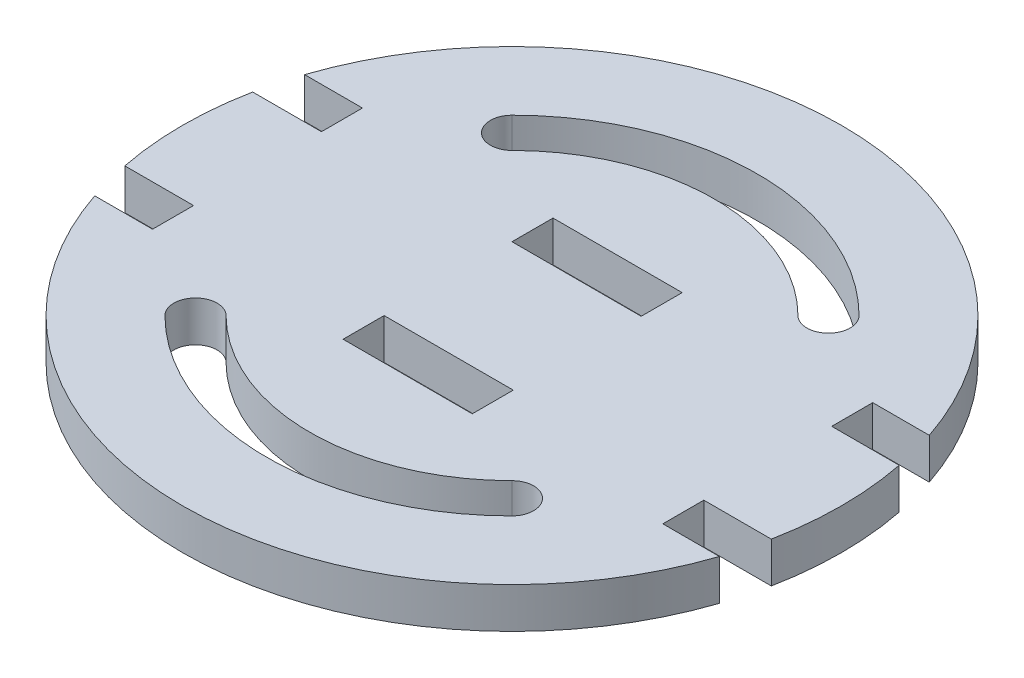
ISO-10303-21;
HEADER;
FILE_DESCRIPTION(('STEP AP214'),'2;1');
FILE_NAME('part.step','',(''),(''),'','','');
FILE_SCHEMA(('AUTOMOTIVE_DESIGN { 1 0 10303 214 1 1 1 1 }'));
ENDSEC;
DATA;
#1=APPLICATION_CONTEXT('core data for automotive mechanical design processes');
#2=APPLICATION_PROTOCOL_DEFINITION('international standard','automotive_design',2000,#1);
#3=PRODUCT_CONTEXT('',#1,'mechanical');
#4=PRODUCT('Part','Part','',(#3));
#5=PRODUCT_RELATED_PRODUCT_CATEGORY('part','',(#4));
#6=PRODUCT_DEFINITION_FORMATION('','',#4);
#7=PRODUCT_DEFINITION_CONTEXT('part definition',#1,'design');
#8=PRODUCT_DEFINITION('design','',#6,#7);
#9=PRODUCT_DEFINITION_SHAPE('','',#8);
#10=(LENGTH_UNIT() NAMED_UNIT(*) SI_UNIT(.MILLI.,.METRE.));
#11=(NAMED_UNIT(*) PLANE_ANGLE_UNIT() SI_UNIT($,.RADIAN.));
#12=(NAMED_UNIT(*) SI_UNIT($,.STERADIAN.) SOLID_ANGLE_UNIT());
#13=UNCERTAINTY_MEASURE_WITH_UNIT(LENGTH_MEASURE(1.E-05),#10,'distance_accuracy_value','');
#14=(GEOMETRIC_REPRESENTATION_CONTEXT(3) GLOBAL_UNCERTAINTY_ASSIGNED_CONTEXT((#13)) GLOBAL_UNIT_ASSIGNED_CONTEXT((#10,
#11,#12)) REPRESENTATION_CONTEXT('',''));
#15=CARTESIAN_POINT('',(0.,0.,0.));
#16=DIRECTION('',(0.,0.,1.));
#17=DIRECTION('',(1.,0.,0.));
#18=AXIS2_PLACEMENT_3D('',#15,#16,#17);
#19=CARTESIAN_POINT('',(0.,6.35,16.4135));
#20=DIRECTION('',(0.,0.,1.));
#21=DIRECTION('',(1.,0.,0.));
#22=AXIS2_PLACEMENT_3D('',#19,#20,#21);
#23=PLANE('',#22);
#24=DIRECTION('',(-1.,0.,0.));
#25=VECTOR('',#24,1.);
#26=CARTESIAN_POINT('',(0.,0.,16.4135));
#27=LINE('',#26,#25);
#28=CARTESIAN_POINT('',(10.2,0.,16.4135));
#29=VERTEX_POINT('',#28);
#30=CARTESIAN_POINT('',(-10.,0.,16.4135));
#31=VERTEX_POINT('',#30);
#32=EDGE_CURVE('E422',#29,#31,#27,.T.);
#33=ORIENTED_EDGE('',*,*,#32,.T.);
#34=DIRECTION('',(0.,-1.,0.));
#35=VECTOR('',#34,1.);
#36=CARTESIAN_POINT('',(-10.,6.35,16.4135));
#37=LINE('',#36,#35);
#38=CARTESIAN_POINT('',(-10.,6.35,16.4135));
#39=VERTEX_POINT('',#38);
#40=EDGE_CURVE('E11',#39,#31,#37,.T.);
#41=ORIENTED_EDGE('',*,*,#40,.F.);
#42=DIRECTION('',(-1.,0.,0.));
#43=VECTOR('',#42,1.);
#44=CARTESIAN_POINT('',(0.,6.35,16.4135));
#45=LINE('',#44,#43);
#46=CARTESIAN_POINT('',(10.2,6.35,16.4135));
#47=VERTEX_POINT('',#46);
#48=EDGE_CURVE('E364',#47,#39,#45,.T.);
#49=ORIENTED_EDGE('',*,*,#48,.F.);
#50=DIRECTION('',(0.,-1.,0.));
#51=VECTOR('',#50,1.);
#52=CARTESIAN_POINT('',(10.2,6.35,16.4135));
#53=LINE('',#52,#51);
#54=EDGE_CURVE('E430',#47,#29,#53,.T.);
#55=ORIENTED_EDGE('',*,*,#54,.T.);
#56=EDGE_LOOP('',(#33,#41,#49,#55));
#57=FACE_BOUND('',#56,.T.);
#58=ADVANCED_FACE('F35',(#57),#23,.F.);
#59=CARTESIAN_POINT('',(-10.,6.35,0.));
#60=DIRECTION('',(-1.,0.,0.));
#61=DIRECTION('',(0.,0.,1.));
#62=AXIS2_PLACEMENT_3D('',#59,#60,#61);
#63=PLANE('',#62);
#64=DIRECTION('',(0.,0.,-1.));
#65=VECTOR('',#64,1.);
#66=CARTESIAN_POINT('',(-10.,0.,0.));
#67=LINE('',#66,#65);
#68=CARTESIAN_POINT('',(-10.,0.,10.));
#69=VERTEX_POINT('',#68);
#70=EDGE_CURVE('E425',#31,#69,#67,.T.);
#71=ORIENTED_EDGE('',*,*,#70,.T.);
#72=DIRECTION('',(0.,-1.,0.));
#73=VECTOR('',#72,1.);
#74=CARTESIAN_POINT('',(-10.,6.35,10.));
#75=LINE('',#74,#73);
#76=CARTESIAN_POINT('',(-10.,6.35,10.));
#77=VERTEX_POINT('',#76);
#78=EDGE_CURVE('E44',#77,#69,#75,.T.);
#79=ORIENTED_EDGE('',*,*,#78,.F.);
#80=DIRECTION('',(0.,0.,-1.));
#81=VECTOR('',#80,1.);
#82=CARTESIAN_POINT('',(-10.,6.35,0.));
#83=LINE('',#82,#81);
#84=EDGE_CURVE('E367',#39,#77,#83,.T.);
#85=ORIENTED_EDGE('',*,*,#84,.F.);
#86=ORIENTED_EDGE('',*,*,#40,.T.);
#87=EDGE_LOOP('',(#71,#79,#85,#86));
#88=FACE_BOUND('',#87,.T.);
#89=ADVANCED_FACE('F516',(#88),#63,.F.);
#90=CARTESIAN_POINT('',(0.,6.35,10.));
#91=DIRECTION('',(0.,0.,-1.));
#92=DIRECTION('',(-1.,0.,0.));
#93=AXIS2_PLACEMENT_3D('',#90,#91,#92);
#94=PLANE('',#93);
#95=DIRECTION('',(1.,0.,0.));
#96=VECTOR('',#95,1.);
#97=CARTESIAN_POINT('',(0.,0.,10.));
#98=LINE('',#97,#96);
#99=CARTESIAN_POINT('',(10.2,0.,10.));
#100=VERTEX_POINT('',#99);
#101=EDGE_CURVE('E427',#69,#100,#98,.T.);
#102=ORIENTED_EDGE('',*,*,#101,.T.);
#103=DIRECTION('',(0.,-1.,0.));
#104=VECTOR('',#103,1.);
#105=CARTESIAN_POINT('',(10.2,6.35,10.));
#106=LINE('',#105,#104);
#107=CARTESIAN_POINT('',(10.2,6.35,10.));
#108=VERTEX_POINT('',#107);
#109=EDGE_CURVE('E433',#108,#100,#106,.T.);
#110=ORIENTED_EDGE('',*,*,#109,.F.);
#111=DIRECTION('',(1.,0.,0.));
#112=VECTOR('',#111,1.);
#113=CARTESIAN_POINT('',(0.,6.35,10.));
#114=LINE('',#113,#112);
#115=EDGE_CURVE('E369',#77,#108,#114,.T.);
#116=ORIENTED_EDGE('',*,*,#115,.F.);
#117=ORIENTED_EDGE('',*,*,#78,.T.);
#118=EDGE_LOOP('',(#102,#110,#116,#117));
#119=FACE_BOUND('',#118,.T.);
#120=ADVANCED_FACE('F522',(#119),#94,.F.);
#121=CARTESIAN_POINT('',(0.,6.35,0.));
#122=DIRECTION('',(0.,-1.,0.));
#123=DIRECTION('',(0.,0.,-1.));
#124=AXIS2_PLACEMENT_3D('',#121,#122,#123);
#125=CYLINDRICAL_SURFACE('',#124,51.5305);
#126=CARTESIAN_POINT('',(0.,0.,0.));
#127=DIRECTION('',(0.,1.,0.));
#128=DIRECTION('',(0.,0.,1.));
#129=AXIS2_PLACEMENT_3D('',#126,#127,#128);
#130=CIRCLE('',#129,51.5305);
#131=CARTESIAN_POINT('',(-50.550889509978,0.,-9.99999999999999));
#132=VERTEX_POINT('',#131);
#133=CARTESIAN_POINT('',(-50.550889509978,0.,9.99999999999999));
#134=VERTEX_POINT('',#133);
#135=EDGE_CURVE('E385',#132,#134,#130,.T.);
#136=ORIENTED_EDGE('',*,*,#135,.T.);
#137=DIRECTION('',(0.,-1.,0.));
#138=VECTOR('',#137,1.);
#139=CARTESIAN_POINT('',(-50.550889509978,6.35,9.99999999999999));
#140=LINE('',#139,#138);
#141=CARTESIAN_POINT('',(-50.550889509978,6.35,9.99999999999999));
#142=VERTEX_POINT('',#141);
#143=EDGE_CURVE('E434',#142,#134,#140,.T.);
#144=ORIENTED_EDGE('',*,*,#143,.F.);
#145=CARTESIAN_POINT('',(0.,6.35,0.));
#146=DIRECTION('',(0.,1.,0.));
#147=DIRECTION('',(0.,0.,1.));
#148=AXIS2_PLACEMENT_3D('',#145,#146,#147);
#149=CIRCLE('',#148,51.5305);
#150=CARTESIAN_POINT('',(-50.550889509978,6.35,-9.99999999999999));
#151=VERTEX_POINT('',#150);
#152=EDGE_CURVE('E328',#151,#142,#149,.T.);
#153=ORIENTED_EDGE('',*,*,#152,.F.);
#154=DIRECTION('',(0.,-1.,0.));
#155=VECTOR('',#154,1.);
#156=CARTESIAN_POINT('',(-50.550889509978,6.35,-9.99999999999999));
#157=LINE('',#156,#155);
#158=EDGE_CURVE('E439',#151,#132,#157,.T.);
#159=ORIENTED_EDGE('',*,*,#158,.T.);
#160=EDGE_LOOP('',(#136,#144,#153,#159));
#161=FACE_BOUND('',#160,.T.);
#162=ADVANCED_FACE('F540',(#161),#125,.T.);
#163=CARTESIAN_POINT('',(0.,6.35,10.));
#164=DIRECTION('',(0.,0.,1.));
#165=DIRECTION('',(1.,0.,0.));
#166=AXIS2_PLACEMENT_3D('',#163,#164,#165);
#167=PLANE('',#166);
#168=DIRECTION('',(-1.,0.,0.));
#169=VECTOR('',#168,1.);
#170=CARTESIAN_POINT('',(0.,0.,10.));
#171=LINE('',#170,#169);
#172=CARTESIAN_POINT('',(-39.8,0.,10.));
#173=VERTEX_POINT('',#172);
#174=EDGE_CURVE('E388',#173,#134,#171,.T.);
#175=ORIENTED_EDGE('',*,*,#174,.F.);
#176=DIRECTION('',(0.,-1.,0.));
#177=VECTOR('',#176,1.);
#178=CARTESIAN_POINT('',(-39.8,6.35,10.));
#179=LINE('',#178,#177);
#180=CARTESIAN_POINT('',(-39.8,6.35,10.));
#181=VERTEX_POINT('',#180);
#182=EDGE_CURVE('E475',#181,#173,#179,.T.);
#183=ORIENTED_EDGE('',*,*,#182,.F.);
#184=DIRECTION('',(-1.,0.,0.));
#185=VECTOR('',#184,1.);
#186=CARTESIAN_POINT('',(0.,6.35,10.));
#187=LINE('',#186,#185);
#188=EDGE_CURVE('E330',#181,#142,#187,.T.);
#189=ORIENTED_EDGE('',*,*,#188,.T.);
#190=ORIENTED_EDGE('',*,*,#143,.T.);
#191=EDGE_LOOP('',(#175,#183,#189,#190));
#192=FACE_BOUND('',#191,.T.);
#193=ADVANCED_FACE('F575',(#192),#167,.T.);
#194=CARTESIAN_POINT('',(-39.8,6.35,0.));
#195=DIRECTION('',(-1.,0.,0.));
#196=DIRECTION('',(0.,0.,1.));
#197=AXIS2_PLACEMENT_3D('',#194,#195,#196);
#198=PLANE('',#197);
#199=DIRECTION('',(0.,0.,-1.));
#200=VECTOR('',#199,1.);
#201=CARTESIAN_POINT('',(-39.8,0.,0.));
#202=LINE('',#201,#200);
#203=CARTESIAN_POINT('',(-39.8,0.,16.4135));
#204=VERTEX_POINT('',#203);
#205=EDGE_CURVE('E393',#204,#173,#202,.T.);
#206=ORIENTED_EDGE('',*,*,#205,.F.);
#207=DIRECTION('',(0.,-1.,0.));
#208=VECTOR('',#207,1.);
#209=CARTESIAN_POINT('',(-39.8,6.35,16.4135));
#210=LINE('',#209,#208);
#211=CARTESIAN_POINT('',(-39.8,6.35,16.4135));
#212=VERTEX_POINT('',#211);
#213=EDGE_CURVE('E473',#212,#204,#210,.T.);
#214=ORIENTED_EDGE('',*,*,#213,.F.);
#215=DIRECTION('',(0.,0.,-1.));
#216=VECTOR('',#215,1.);
#217=CARTESIAN_POINT('',(-39.8,6.35,0.));
#218=LINE('',#217,#216);
#219=EDGE_CURVE('E335',#212,#181,#218,.T.);
#220=ORIENTED_EDGE('',*,*,#219,.T.);
#221=ORIENTED_EDGE('',*,*,#182,.T.);
#222=EDGE_LOOP('',(#206,#214,#220,#221));
#223=FACE_BOUND('',#222,.T.);
#224=ADVANCED_FACE('F572',(#223),#198,.T.);
#225=CARTESIAN_POINT('',(0.,6.35,16.4135));
#226=DIRECTION('',(0.,0.,-1.));
#227=DIRECTION('',(-1.,0.,0.));
#228=AXIS2_PLACEMENT_3D('',#225,#226,#227);
#229=PLANE('',#228);
#230=DIRECTION('',(1.,0.,0.));
#231=VECTOR('',#230,1.);
#232=CARTESIAN_POINT('',(0.,0.,16.4135));
#233=LINE('',#232,#231);
#234=CARTESIAN_POINT('',(-48.8465909557668,0.,16.4135));
#235=VERTEX_POINT('',#234);
#236=EDGE_CURVE('E396',#235,#204,#233,.T.);
#237=ORIENTED_EDGE('',*,*,#236,.F.);
#238=DIRECTION('',(0.,-1.,0.));
#239=VECTOR('',#238,1.);
#240=CARTESIAN_POINT('',(-48.8465909557668,6.35,16.4135));
#241=LINE('',#240,#239);
#242=CARTESIAN_POINT('',(-48.8465909557668,6.35,16.4135));
#243=VERTEX_POINT('',#242);
#244=EDGE_CURVE('E471',#243,#235,#241,.T.);
#245=ORIENTED_EDGE('',*,*,#244,.F.);
#246=DIRECTION('',(1.,0.,0.));
#247=VECTOR('',#246,1.);
#248=CARTESIAN_POINT('',(0.,6.35,16.4135));
#249=LINE('',#248,#247);
#250=EDGE_CURVE('E338',#243,#212,#249,.T.);
#251=ORIENTED_EDGE('',*,*,#250,.T.);
#252=ORIENTED_EDGE('',*,*,#213,.T.);
#253=EDGE_LOOP('',(#237,#245,#251,#252));
#254=FACE_BOUND('',#253,.T.);
#255=ADVANCED_FACE('F568',(#254),#229,.T.);
#256=CARTESIAN_POINT('',(0.,6.35,0.));
#257=DIRECTION('',(0.,-1.,0.));
#258=DIRECTION('',(0.,0.,-1.));
#259=AXIS2_PLACEMENT_3D('',#256,#257,#258);
#260=CYLINDRICAL_SURFACE('',#259,51.5305);
#261=CARTESIAN_POINT('',(0.,0.,0.));
#262=DIRECTION('',(0.,1.,0.));
#263=DIRECTION('',(0.,0.,1.));
#264=AXIS2_PLACEMENT_3D('',#261,#262,#263);
#265=CIRCLE('',#264,51.5305);
#266=CARTESIAN_POINT('',(48.8465909557668,0.,16.4135));
#267=VERTEX_POINT('',#266);
#268=EDGE_CURVE('E399',#235,#267,#265,.T.);
#269=ORIENTED_EDGE('',*,*,#268,.T.);
#270=DIRECTION('',(0.,-1.,0.));
#271=VECTOR('',#270,1.);
#272=CARTESIAN_POINT('',(48.8465909557668,6.35,16.4135));
#273=LINE('',#272,#271);
#274=CARTESIAN_POINT('',(48.8465909557668,6.35,16.4135));
#275=VERTEX_POINT('',#274);
#276=EDGE_CURVE('E468',#275,#267,#273,.T.);
#277=ORIENTED_EDGE('',*,*,#276,.F.);
#278=CARTESIAN_POINT('',(0.,6.35,0.));
#279=DIRECTION('',(0.,1.,0.));
#280=DIRECTION('',(0.,0.,1.));
#281=AXIS2_PLACEMENT_3D('',#278,#279,#280);
#282=CIRCLE('',#281,51.5305);
#283=EDGE_CURVE('E341',#243,#275,#282,.T.);
#284=ORIENTED_EDGE('',*,*,#283,.F.);
#285=ORIENTED_EDGE('',*,*,#244,.T.);
#286=EDGE_LOOP('',(#269,#277,#284,#285));
#287=FACE_BOUND('',#286,.T.);
#288=ADVANCED_FACE('F564',(#287),#260,.T.);
#289=CARTESIAN_POINT('',(0.,6.35,16.4135));
#290=DIRECTION('',(0.,0.,1.));
#291=DIRECTION('',(1.,0.,0.));
#292=AXIS2_PLACEMENT_3D('',#289,#290,#291);
#293=PLANE('',#292);
#294=DIRECTION('',(-1.,0.,0.));
#295=VECTOR('',#294,1.);
#296=CARTESIAN_POINT('',(0.,0.,16.4135));
#297=LINE('',#296,#295);
#298=CARTESIAN_POINT('',(40.,0.,16.4135));
#299=VERTEX_POINT('',#298);
#300=EDGE_CURVE('E401',#267,#299,#297,.T.);
#301=ORIENTED_EDGE('',*,*,#300,.T.);
#302=DIRECTION('',(0.,-1.,0.));
#303=VECTOR('',#302,1.);
#304=CARTESIAN_POINT('',(40.,6.35,16.4135));
#305=LINE('',#304,#303);
#306=CARTESIAN_POINT('',(40.,6.35,16.4135));
#307=VERTEX_POINT('',#306);
#308=EDGE_CURVE('E465',#307,#299,#305,.T.);
#309=ORIENTED_EDGE('',*,*,#308,.F.);
#310=DIRECTION('',(-1.,0.,0.));
#311=VECTOR('',#310,1.);
#312=CARTESIAN_POINT('',(0.,6.35,16.4135));
#313=LINE('',#312,#311);
#314=EDGE_CURVE('E343',#275,#307,#313,.T.);
#315=ORIENTED_EDGE('',*,*,#314,.F.);
#316=ORIENTED_EDGE('',*,*,#276,.T.);
#317=EDGE_LOOP('',(#301,#309,#315,#316));
#318=FACE_BOUND('',#317,.T.);
#319=ADVANCED_FACE('F560',(#318),#293,.F.);
#320=CARTESIAN_POINT('',(40.,6.35,0.));
#321=DIRECTION('',(-1.,0.,0.));
#322=DIRECTION('',(0.,0.,1.));
#323=AXIS2_PLACEMENT_3D('',#320,#321,#322);
#324=PLANE('',#323);
#325=DIRECTION('',(0.,0.,-1.));
#326=VECTOR('',#325,1.);
#327=CARTESIAN_POINT('',(40.,0.,0.));
#328=LINE('',#327,#326);
#329=CARTESIAN_POINT('',(40.,0.,10.));
#330=VERTEX_POINT('',#329);
#331=EDGE_CURVE('E403',#299,#330,#328,.T.);
#332=ORIENTED_EDGE('',*,*,#331,.T.);
#333=DIRECTION('',(0.,-1.,0.));
#334=VECTOR('',#333,1.);
#335=CARTESIAN_POINT('',(40.,6.35,10.));
#336=LINE('',#335,#334);
#337=CARTESIAN_POINT('',(40.,6.35,10.));
#338=VERTEX_POINT('',#337);
#339=EDGE_CURVE('E462',#338,#330,#336,.T.);
#340=ORIENTED_EDGE('',*,*,#339,.F.);
#341=DIRECTION('',(0.,0.,-1.));
#342=VECTOR('',#341,1.);
#343=CARTESIAN_POINT('',(40.,6.35,0.));
#344=LINE('',#343,#342);
#345=EDGE_CURVE('E345',#307,#338,#344,.T.);
#346=ORIENTED_EDGE('',*,*,#345,.F.);
#347=ORIENTED_EDGE('',*,*,#308,.T.);
#348=EDGE_LOOP('',(#332,#340,#346,#347));
#349=FACE_BOUND('',#348,.T.);
#350=ADVANCED_FACE('F556',(#349),#324,.F.);
#351=CARTESIAN_POINT('',(0.,6.35,9.99999999999998));
#352=DIRECTION('',(0.,0.,-1.));
#353=DIRECTION('',(-1.,0.,0.));
#354=AXIS2_PLACEMENT_3D('',#351,#352,#353);
#355=PLANE('',#354);
#356=DIRECTION('',(1.,0.,0.));
#357=VECTOR('',#356,1.);
#358=CARTESIAN_POINT('',(0.,0.,9.99999999999998));
#359=LINE('',#358,#357);
#360=CARTESIAN_POINT('',(50.550889509978,0.,10.));
#361=VERTEX_POINT('',#360);
#362=EDGE_CURVE('E405',#330,#361,#359,.T.);
#363=ORIENTED_EDGE('',*,*,#362,.T.);
#364=DIRECTION('',(0.,-1.,0.));
#365=VECTOR('',#364,1.);
#366=CARTESIAN_POINT('',(50.550889509978,6.35,10.));
#367=LINE('',#366,#365);
#368=CARTESIAN_POINT('',(50.550889509978,6.35,10.));
#369=VERTEX_POINT('',#368);
#370=EDGE_CURVE('E459',#369,#361,#367,.T.);
#371=ORIENTED_EDGE('',*,*,#370,.F.);
#372=DIRECTION('',(1.,0.,0.));
#373=VECTOR('',#372,1.);
#374=CARTESIAN_POINT('',(0.,6.35,9.99999999999998));
#375=LINE('',#374,#373);
#376=EDGE_CURVE('E347',#338,#369,#375,.T.);
#377=ORIENTED_EDGE('',*,*,#376,.F.);
#378=ORIENTED_EDGE('',*,*,#339,.T.);
#379=EDGE_LOOP('',(#363,#371,#377,#378));
#380=FACE_BOUND('',#379,.T.);
#381=ADVANCED_FACE('F553',(#380),#355,.F.);
#382=CARTESIAN_POINT('',(50.550889509978,0.,-10.));
#383=VERTEX_POINT('',#382);
#384=EDGE_CURVE('E390',#361,#383,#130,.T.);
#385=ORIENTED_EDGE('',*,*,#384,.T.);
#386=DIRECTION('',(0.,-1.,0.));
#387=VECTOR('',#386,1.);
#388=CARTESIAN_POINT('',(50.550889509978,6.35,-10.));
#389=LINE('',#388,#387);
#390=CARTESIAN_POINT('',(50.550889509978,6.35,-10.));
#391=VERTEX_POINT('',#390);
#392=EDGE_CURVE('E457',#391,#383,#389,.T.);
#393=ORIENTED_EDGE('',*,*,#392,.F.);
#394=EDGE_CURVE('E332',#369,#391,#149,.T.);
#395=ORIENTED_EDGE('',*,*,#394,.F.);
#396=ORIENTED_EDGE('',*,*,#370,.T.);
#397=EDGE_LOOP('',(#385,#393,#395,#396));
#398=FACE_BOUND('',#397,.T.);
#399=ADVANCED_FACE('F541',(#398),#125,.T.);
#400=CARTESIAN_POINT('',(0.,6.35,-9.99999999999998));
#401=DIRECTION('',(0.,0.,-1.));
#402=DIRECTION('',(-1.,0.,0.));
#403=AXIS2_PLACEMENT_3D('',#400,#401,#402);
#404=PLANE('',#403);
#405=DIRECTION('',(1.,0.,0.));
#406=VECTOR('',#405,1.);
#407=CARTESIAN_POINT('',(0.,0.,-9.99999999999998));
#408=LINE('',#407,#406);
#409=CARTESIAN_POINT('',(40.,0.,-10.));
#410=VERTEX_POINT('',#409);
#411=EDGE_CURVE('E407',#410,#383,#408,.T.);
#412=ORIENTED_EDGE('',*,*,#411,.F.);
#413=DIRECTION('',(0.,-1.,0.));
#414=VECTOR('',#413,1.);
#415=CARTESIAN_POINT('',(40.,6.35,-10.));
#416=LINE('',#415,#414);
#417=CARTESIAN_POINT('',(40.,6.35,-10.));
#418=VERTEX_POINT('',#417);
#419=EDGE_CURVE('E455',#418,#410,#416,.T.);
#420=ORIENTED_EDGE('',*,*,#419,.F.);
#421=DIRECTION('',(1.,0.,0.));
#422=VECTOR('',#421,1.);
#423=CARTESIAN_POINT('',(0.,6.35,-9.99999999999998));
#424=LINE('',#423,#422);
#425=EDGE_CURVE('E349',#418,#391,#424,.T.);
#426=ORIENTED_EDGE('',*,*,#425,.T.);
#427=ORIENTED_EDGE('',*,*,#392,.T.);
#428=EDGE_LOOP('',(#412,#420,#426,#427));
#429=FACE_BOUND('',#428,.T.);
#430=ADVANCED_FACE('F548',(#429),#404,.T.);
#431=CARTESIAN_POINT('',(40.,6.35,0.));
#432=DIRECTION('',(1.,0.,0.));
#433=DIRECTION('',(0.,0.,-1.));
#434=AXIS2_PLACEMENT_3D('',#431,#432,#433);
#435=PLANE('',#434);
#436=DIRECTION('',(0.,0.,1.));
#437=VECTOR('',#436,1.);
#438=CARTESIAN_POINT('',(40.,0.,0.));
#439=LINE('',#438,#437);
#440=CARTESIAN_POINT('',(40.,0.,-16.4135));
#441=VERTEX_POINT('',#440);
#442=EDGE_CURVE('E410',#441,#410,#439,.T.);
#443=ORIENTED_EDGE('',*,*,#442,.F.);
#444=DIRECTION('',(0.,-1.,0.));
#445=VECTOR('',#444,1.);
#446=CARTESIAN_POINT('',(40.,6.35,-16.4135));
#447=LINE('',#446,#445);
#448=CARTESIAN_POINT('',(40.,6.35,-16.4135));
#449=VERTEX_POINT('',#448);
#450=EDGE_CURVE('E453',#449,#441,#447,.T.);
#451=ORIENTED_EDGE('',*,*,#450,.F.);
#452=DIRECTION('',(0.,0.,1.));
#453=VECTOR('',#452,1.);
#454=CARTESIAN_POINT('',(40.,6.35,0.));
#455=LINE('',#454,#453);
#456=EDGE_CURVE('E352',#449,#418,#455,.T.);
#457=ORIENTED_EDGE('',*,*,#456,.T.);
#458=ORIENTED_EDGE('',*,*,#419,.T.);
#459=EDGE_LOOP('',(#443,#451,#457,#458));
#460=FACE_BOUND('',#459,.T.);
#461=ADVANCED_FACE('F544',(#460),#435,.T.);
#462=CARTESIAN_POINT('',(0.,6.35,-16.4135));
#463=DIRECTION('',(0.,0.,1.));
#464=DIRECTION('',(1.,0.,0.));
#465=AXIS2_PLACEMENT_3D('',#462,#463,#464);
#466=PLANE('',#465);
#467=DIRECTION('',(-1.,0.,0.));
#468=VECTOR('',#467,1.);
#469=CARTESIAN_POINT('',(0.,0.,-16.4135));
#470=LINE('',#469,#468);
#471=CARTESIAN_POINT('',(48.8465909557668,0.,-16.4135));
#472=VERTEX_POINT('',#471);
#473=EDGE_CURVE('E413',#472,#441,#470,.T.);
#474=ORIENTED_EDGE('',*,*,#473,.F.);
#475=DIRECTION('',(0.,-1.,0.));
#476=VECTOR('',#475,1.);
#477=CARTESIAN_POINT('',(48.8465909557668,6.35,-16.4135));
#478=LINE('',#477,#476);
#479=CARTESIAN_POINT('',(48.8465909557668,6.35,-16.4135));
#480=VERTEX_POINT('',#479);
#481=EDGE_CURVE('E451',#480,#472,#478,.T.);
#482=ORIENTED_EDGE('',*,*,#481,.F.);
#483=DIRECTION('',(-1.,0.,0.));
#484=VECTOR('',#483,1.);
#485=CARTESIAN_POINT('',(0.,6.35,-16.4135));
#486=LINE('',#485,#484);
#487=EDGE_CURVE('E355',#480,#449,#486,.T.);
#488=ORIENTED_EDGE('',*,*,#487,.T.);
#489=ORIENTED_EDGE('',*,*,#450,.T.);
#490=EDGE_LOOP('',(#474,#482,#488,#489));
#491=FACE_BOUND('',#490,.T.);
#492=ADVANCED_FACE('F538',(#491),#466,.T.);
#493=CARTESIAN_POINT('',(-48.8465909557668,0.,-16.4135));
#494=VERTEX_POINT('',#493);
#495=EDGE_CURVE('E389',#472,#494,#130,.T.);
#496=ORIENTED_EDGE('',*,*,#495,.T.);
#497=DIRECTION('',(0.,-1.,0.));
#498=VECTOR('',#497,1.);
#499=CARTESIAN_POINT('',(-48.8465909557668,6.35,-16.4135));
#500=LINE('',#499,#498);
#501=CARTESIAN_POINT('',(-48.8465909557668,6.35,-16.4135));
#502=VERTEX_POINT('',#501);
#503=EDGE_CURVE('E448',#502,#494,#500,.T.);
#504=ORIENTED_EDGE('',*,*,#503,.F.);
#505=EDGE_CURVE('E331',#480,#502,#149,.T.);
#506=ORIENTED_EDGE('',*,*,#505,.F.);
#507=ORIENTED_EDGE('',*,*,#481,.T.);
#508=EDGE_LOOP('',(#496,#504,#506,#507));
#509=FACE_BOUND('',#508,.T.);
#510=ADVANCED_FACE('F534',(#509),#125,.T.);
#511=CARTESIAN_POINT('',(0.,6.35,-16.4135));
#512=DIRECTION('',(0.,0.,-1.));
#513=DIRECTION('',(-1.,0.,0.));
#514=AXIS2_PLACEMENT_3D('',#511,#512,#513);
#515=PLANE('',#514);
#516=DIRECTION('',(1.,0.,0.));
#517=VECTOR('',#516,1.);
#518=CARTESIAN_POINT('',(0.,0.,-16.4135));
#519=LINE('',#518,#517);
#520=CARTESIAN_POINT('',(-39.8,0.,-16.4135));
#521=VERTEX_POINT('',#520);
#522=EDGE_CURVE('E416',#494,#521,#519,.T.);
#523=ORIENTED_EDGE('',*,*,#522,.T.);
#524=DIRECTION('',(0.,-1.,0.));
#525=VECTOR('',#524,1.);
#526=CARTESIAN_POINT('',(-39.8,6.35,-16.4135));
#527=LINE('',#526,#525);
#528=CARTESIAN_POINT('',(-39.8,6.35,-16.4135));
#529=VERTEX_POINT('',#528);
#530=EDGE_CURVE('E445',#529,#521,#527,.T.);
#531=ORIENTED_EDGE('',*,*,#530,.F.);
#532=DIRECTION('',(1.,0.,0.));
#533=VECTOR('',#532,1.);
#534=CARTESIAN_POINT('',(0.,6.35,-16.4135));
#535=LINE('',#534,#533);
#536=EDGE_CURVE('E358',#502,#529,#535,.T.);
#537=ORIENTED_EDGE('',*,*,#536,.F.);
#538=ORIENTED_EDGE('',*,*,#503,.T.);
#539=EDGE_LOOP('',(#523,#531,#537,#538));
#540=FACE_BOUND('',#539,.T.);
#541=ADVANCED_FACE('F530',(#540),#515,.F.);
#542=CARTESIAN_POINT('',(-39.8,6.35,0.));
#543=DIRECTION('',(1.,0.,0.));
#544=DIRECTION('',(0.,0.,-1.));
#545=AXIS2_PLACEMENT_3D('',#542,#543,#544);
#546=PLANE('',#545);
#547=DIRECTION('',(0.,0.,1.));
#548=VECTOR('',#547,1.);
#549=CARTESIAN_POINT('',(-39.8,0.,0.));
#550=LINE('',#549,#548);
#551=CARTESIAN_POINT('',(-39.8,0.,-10.));
#552=VERTEX_POINT('',#551);
#553=EDGE_CURVE('E418',#521,#552,#550,.T.);
#554=ORIENTED_EDGE('',*,*,#553,.T.);
#555=DIRECTION('',(0.,-1.,0.));
#556=VECTOR('',#555,1.);
#557=CARTESIAN_POINT('',(-39.8,6.35,-10.));
#558=LINE('',#557,#556);
#559=CARTESIAN_POINT('',(-39.8,6.35,-10.));
#560=VERTEX_POINT('',#559);
#561=EDGE_CURVE('E442',#560,#552,#558,.T.);
#562=ORIENTED_EDGE('',*,*,#561,.F.);
#563=DIRECTION('',(0.,0.,1.));
#564=VECTOR('',#563,1.);
#565=CARTESIAN_POINT('',(-39.8,6.35,0.));
#566=LINE('',#565,#564);
#567=EDGE_CURVE('E360',#529,#560,#566,.T.);
#568=ORIENTED_EDGE('',*,*,#567,.F.);
#569=ORIENTED_EDGE('',*,*,#530,.T.);
#570=EDGE_LOOP('',(#554,#562,#568,#569));
#571=FACE_BOUND('',#570,.T.);
#572=ADVANCED_FACE('F527',(#571),#546,.F.);
#573=CARTESIAN_POINT('',(0.,6.35,-16.4135));
#574=DIRECTION('',(0.,0.,1.));
#575=DIRECTION('',(1.,0.,0.));
#576=AXIS2_PLACEMENT_3D('',#573,#574,#575);
#577=PLANE('',#576);
#578=DIRECTION('',(-1.,0.,0.));
#579=VECTOR('',#578,1.);
#580=CARTESIAN_POINT('',(0.,0.,-16.4135));
#581=LINE('',#580,#579);
#582=CARTESIAN_POINT('',(10.2,0.,-16.4135));
#583=VERTEX_POINT('',#582);
#584=CARTESIAN_POINT('',(-10.,0.,-16.4135));
#585=VERTEX_POINT('',#584);
#586=EDGE_CURVE('E308',#583,#585,#581,.T.);
#587=ORIENTED_EDGE('',*,*,#586,.F.);
#588=DIRECTION('',(0.,-1.,0.));
#589=VECTOR('',#588,1.);
#590=CARTESIAN_POINT('',(10.2,6.35,-16.4135));
#591=LINE('',#590,#589);
#592=CARTESIAN_POINT('',(10.2,6.35,-16.4135));
#593=VERTEX_POINT('',#592);
#594=EDGE_CURVE('E39',#593,#583,#591,.T.);
#595=ORIENTED_EDGE('',*,*,#594,.F.);
#596=DIRECTION('',(-1.,0.,0.));
#597=VECTOR('',#596,1.);
#598=CARTESIAN_POINT('',(0.,6.35,-16.4135));
#599=LINE('',#598,#597);
#600=CARTESIAN_POINT('',(-10.,6.35,-16.4135));
#601=VERTEX_POINT('',#600);
#602=EDGE_CURVE('E315',#593,#601,#599,.T.);
#603=ORIENTED_EDGE('',*,*,#602,.T.);
#604=DIRECTION('',(0.,-1.,0.));
#605=VECTOR('',#604,1.);
#606=CARTESIAN_POINT('',(-10.,6.35,-16.4135));
#607=LINE('',#606,#605);
#608=EDGE_CURVE('E373',#601,#585,#607,.T.);
#609=ORIENTED_EDGE('',*,*,#608,.T.);
#610=EDGE_LOOP('',(#587,#595,#603,#609));
#611=FACE_BOUND('',#610,.T.);
#612=ADVANCED_FACE('F37',(#611),#577,.T.);
#613=CARTESIAN_POINT('',(10.2,6.35,0.));
#614=DIRECTION('',(-1.,0.,0.));
#615=DIRECTION('',(0.,0.,1.));
#616=AXIS2_PLACEMENT_3D('',#613,#614,#615);
#617=PLANE('',#616);
#618=DIRECTION('',(0.,0.,-1.));
#619=VECTOR('',#618,1.);
#620=CARTESIAN_POINT('',(10.2,0.,0.));
#621=LINE('',#620,#619);
#622=CARTESIAN_POINT('',(10.2,0.,-10.));
#623=VERTEX_POINT('',#622);
#624=EDGE_CURVE('E376',#623,#583,#621,.T.);
#625=ORIENTED_EDGE('',*,*,#624,.F.);
#626=DIRECTION('',(0.,-1.,0.));
#627=VECTOR('',#626,1.);
#628=CARTESIAN_POINT('',(10.2,6.35,-10.));
#629=LINE('',#628,#627);
#630=CARTESIAN_POINT('',(10.2,6.35,-10.));
#631=VERTEX_POINT('',#630);
#632=EDGE_CURVE('E480',#631,#623,#629,.T.);
#633=ORIENTED_EDGE('',*,*,#632,.F.);
#634=DIRECTION('',(0.,0.,-1.));
#635=VECTOR('',#634,1.);
#636=CARTESIAN_POINT('',(10.2,6.35,0.));
#637=LINE('',#636,#635);
#638=EDGE_CURVE('E318',#631,#593,#637,.T.);
#639=ORIENTED_EDGE('',*,*,#638,.T.);
#640=ORIENTED_EDGE('',*,*,#594,.T.);
#641=EDGE_LOOP('',(#625,#633,#639,#640));
#642=FACE_BOUND('',#641,.T.);
#643=ADVANCED_FACE('F486',(#642),#617,.T.);
#644=CARTESIAN_POINT('',(0.,6.35,-10.));
#645=DIRECTION('',(0.,0.,-1.));
#646=DIRECTION('',(-1.,0.,0.));
#647=AXIS2_PLACEMENT_3D('',#644,#645,#646);
#648=PLANE('',#647);
#649=DIRECTION('',(1.,0.,0.));
#650=VECTOR('',#649,1.);
#651=CARTESIAN_POINT('',(0.,0.,-10.));
#652=LINE('',#651,#650);
#653=CARTESIAN_POINT('',(-10.,0.,-10.));
#654=VERTEX_POINT('',#653);
#655=EDGE_CURVE('E379',#654,#623,#652,.T.);
#656=ORIENTED_EDGE('',*,*,#655,.F.);
#657=DIRECTION('',(0.,-1.,0.));
#658=VECTOR('',#657,1.);
#659=CARTESIAN_POINT('',(-10.,6.35,-10.));
#660=LINE('',#659,#658);
#661=CARTESIAN_POINT('',(-10.,6.35,-10.));
#662=VERTEX_POINT('',#661);
#663=EDGE_CURVE('E479',#662,#654,#660,.T.);
#664=ORIENTED_EDGE('',*,*,#663,.F.);
#665=DIRECTION('',(1.,0.,0.));
#666=VECTOR('',#665,1.);
#667=CARTESIAN_POINT('',(0.,6.35,-10.));
#668=LINE('',#667,#666);
#669=EDGE_CURVE('E322',#662,#631,#668,.T.);
#670=ORIENTED_EDGE('',*,*,#669,.T.);
#671=ORIENTED_EDGE('',*,*,#632,.T.);
#672=EDGE_LOOP('',(#656,#664,#670,#671));
#673=FACE_BOUND('',#672,.T.);
#674=ADVANCED_FACE('F493',(#673),#648,.T.);
#675=CARTESIAN_POINT('',(0.,6.35,-10.));
#676=DIRECTION('',(0.,0.,1.));
#677=DIRECTION('',(1.,0.,0.));
#678=AXIS2_PLACEMENT_3D('',#675,#676,#677);
#679=PLANE('',#678);
#680=DIRECTION('',(-1.,0.,0.));
#681=VECTOR('',#680,1.);
#682=CARTESIAN_POINT('',(0.,0.,-10.));
#683=LINE('',#682,#681);
#684=EDGE_CURVE('E420',#552,#132,#683,.T.);
#685=ORIENTED_EDGE('',*,*,#684,.T.);
#686=ORIENTED_EDGE('',*,*,#158,.F.);
#687=DIRECTION('',(-1.,0.,0.));
#688=VECTOR('',#687,1.);
#689=CARTESIAN_POINT('',(0.,6.35,-10.));
#690=LINE('',#689,#688);
#691=EDGE_CURVE('E362',#560,#151,#690,.T.);
#692=ORIENTED_EDGE('',*,*,#691,.F.);
#693=ORIENTED_EDGE('',*,*,#561,.T.);
#694=EDGE_LOOP('',(#685,#686,#692,#693));
#695=FACE_BOUND('',#694,.T.);
#696=ADVANCED_FACE('F503',(#695),#679,.F.);
#697=CARTESIAN_POINT('',(-10.,6.35,0.));
#698=DIRECTION('',(1.,0.,0.));
#699=DIRECTION('',(0.,0.,-1.));
#700=AXIS2_PLACEMENT_3D('',#697,#698,#699);
#701=PLANE('',#700);
#702=DIRECTION('',(0.,0.,1.));
#703=VECTOR('',#702,1.);
#704=CARTESIAN_POINT('',(-10.,0.,0.));
#705=LINE('',#704,#703);
#706=EDGE_CURVE('E382',#585,#654,#705,.T.);
#707=ORIENTED_EDGE('',*,*,#706,.F.);
#708=ORIENTED_EDGE('',*,*,#608,.F.);
#709=DIRECTION('',(0.,0.,1.));
#710=VECTOR('',#709,1.);
#711=CARTESIAN_POINT('',(-10.,6.35,0.));
#712=LINE('',#711,#710);
#713=EDGE_CURVE('E325',#601,#662,#712,.T.);
#714=ORIENTED_EDGE('',*,*,#713,.T.);
#715=ORIENTED_EDGE('',*,*,#663,.T.);
#716=EDGE_LOOP('',(#707,#708,#714,#715));
#717=FACE_BOUND('',#716,.T.);
#718=ADVANCED_FACE('F500',(#717),#701,.T.);
#719=CARTESIAN_POINT('',(10.2,6.35,0.));
#720=DIRECTION('',(1.,0.,0.));
#721=DIRECTION('',(0.,0.,-1.));
#722=AXIS2_PLACEMENT_3D('',#719,#720,#721);
#723=PLANE('',#722);
#724=DIRECTION('',(0.,0.,1.));
#725=VECTOR('',#724,1.);
#726=CARTESIAN_POINT('',(10.2,0.,0.));
#727=LINE('',#726,#725);
#728=EDGE_CURVE('E319',#100,#29,#727,.T.);
#729=ORIENTED_EDGE('',*,*,#728,.T.);
#730=ORIENTED_EDGE('',*,*,#54,.F.);
#731=DIRECTION('',(0.,0.,1.));
#732=VECTOR('',#731,1.);
#733=CARTESIAN_POINT('',(10.2,6.35,0.));
#734=LINE('',#733,#732);
#735=EDGE_CURVE('E371',#108,#47,#734,.T.);
#736=ORIENTED_EDGE('',*,*,#735,.F.);
#737=ORIENTED_EDGE('',*,*,#109,.T.);
#738=EDGE_LOOP('',(#729,#730,#736,#737));
#739=FACE_BOUND('',#738,.T.);
#740=ADVANCED_FACE('F502',(#739),#723,.F.);
#741=CARTESIAN_POINT('',(0.,6.35,0.));
#742=DIRECTION('',(0.,1.,0.));
#743=DIRECTION('',(0.,0.,1.));
#744=AXIS2_PLACEMENT_3D('',#741,#742,#743);
#745=PLANE('',#744);
#746=CARTESIAN_POINT('',(-24.7487373415291,6.35,-24.7487373415292));
#747=DIRECTION('',(0.,1.,0.));
#748=DIRECTION('',(0.,0.,-1.));
#749=AXIS2_PLACEMENT_3D('',#746,#747,#748);
#750=CIRCLE('',#749,3.3782);
#751=CARTESIAN_POINT('',(-27.1374854697336,6.35,-27.1374854697336));
#752=VERTEX_POINT('',#751);
#753=CARTESIAN_POINT('',(-22.3599892133248,6.35,-22.3599892133248));
#754=VERTEX_POINT('',#753);
#755=EDGE_CURVE('E52',#752,#754,#750,.T.);
#756=ORIENTED_EDGE('',*,*,#755,.F.);
#757=CARTESIAN_POINT('',(0.,6.35,0.));
#758=DIRECTION('',(0.,1.,0.));
#759=DIRECTION('',(0.,0.,-1.));
#760=AXIS2_PLACEMENT_3D('',#757,#758,#759);
#761=CIRCLE('',#760,38.3782);
#762=CARTESIAN_POINT('',(27.1374854697337,6.35,-27.1374854697334));
#763=VERTEX_POINT('',#762);
#764=EDGE_CURVE('E264',#763,#752,#761,.T.);
#765=ORIENTED_EDGE('',*,*,#764,.F.);
#766=CARTESIAN_POINT('',(24.7487373415292,6.35,-24.7487373415292));
#767=DIRECTION('',(0.,1.,0.));
#768=DIRECTION('',(0.,0.,-1.));
#769=AXIS2_PLACEMENT_3D('',#766,#767,#768);
#770=CIRCLE('',#769,3.3782);
#771=CARTESIAN_POINT('',(22.3599892133249,6.35,-22.3599892133246));
#772=VERTEX_POINT('',#771);
#773=EDGE_CURVE('E267',#772,#763,#770,.T.);
#774=ORIENTED_EDGE('',*,*,#773,.F.);
#775=CARTESIAN_POINT('',(0.,6.35,0.));
#776=DIRECTION('',(0.,-1.,0.));
#777=DIRECTION('',(0.,0.,-1.));
#778=AXIS2_PLACEMENT_3D('',#775,#776,#777);
#779=CIRCLE('',#778,31.6218);
#780=EDGE_CURVE('E273',#754,#772,#779,.T.);
#781=ORIENTED_EDGE('',*,*,#780,.F.);
#782=EDGE_LOOP('',(#756,#765,#774,#781));
#783=FACE_BOUND('',#782,.T.);
#784=CARTESIAN_POINT('',(-24.7487373415291,6.35,24.7487373415292));
#785=DIRECTION('',(0.,1.,0.));
#786=DIRECTION('',(0.,0.,1.));
#787=AXIS2_PLACEMENT_3D('',#784,#785,#786);
#788=CIRCLE('',#787,3.3782);
#789=CARTESIAN_POINT('',(-22.3599892133248,6.35,22.3599892133248));
#790=VERTEX_POINT('',#789);
#791=CARTESIAN_POINT('',(-27.1374854697336,6.35,27.1374854697336));
#792=VERTEX_POINT('',#791);
#793=EDGE_CURVE('E279',#790,#792,#788,.T.);
#794=ORIENTED_EDGE('',*,*,#793,.F.);
#795=CARTESIAN_POINT('',(0.,6.35,0.));
#796=DIRECTION('',(0.,-1.,0.));
#797=DIRECTION('',(0.,0.,1.));
#798=AXIS2_PLACEMENT_3D('',#795,#796,#797);
#799=CIRCLE('',#798,31.6218);
#800=CARTESIAN_POINT('',(22.3599892133249,6.35,22.3599892133246));
#801=VERTEX_POINT('',#800);
#802=EDGE_CURVE('E287',#801,#790,#799,.T.);
#803=ORIENTED_EDGE('',*,*,#802,.F.);
#804=CARTESIAN_POINT('',(24.7487373415293,6.35,24.748737341529));
#805=DIRECTION('',(0.,1.,0.));
#806=DIRECTION('',(0.,0.,1.));
#807=AXIS2_PLACEMENT_3D('',#804,#805,#806);
#808=CIRCLE('',#807,3.3782);
#809=CARTESIAN_POINT('',(27.1374854697337,6.35,27.1374854697334));
#810=VERTEX_POINT('',#809);
#811=EDGE_CURVE('E301',#810,#801,#808,.T.);
#812=ORIENTED_EDGE('',*,*,#811,.F.);
#813=CARTESIAN_POINT('',(0.,6.35,0.));
#814=DIRECTION('',(0.,1.,0.));
#815=DIRECTION('',(0.,0.,1.));
#816=AXIS2_PLACEMENT_3D('',#813,#814,#815);
#817=CIRCLE('',#816,38.3782);
#818=EDGE_CURVE('E298',#792,#810,#817,.T.);
#819=ORIENTED_EDGE('',*,*,#818,.F.);
#820=EDGE_LOOP('',(#794,#803,#812,#819));
#821=FACE_BOUND('',#820,.T.);
#822=ORIENTED_EDGE('',*,*,#602,.F.);
#823=ORIENTED_EDGE('',*,*,#638,.F.);
#824=ORIENTED_EDGE('',*,*,#669,.F.);
#825=ORIENTED_EDGE('',*,*,#713,.F.);
#826=EDGE_LOOP('',(#822,#823,#824,#825));
#827=FACE_BOUND('',#826,.T.);
#828=ORIENTED_EDGE('',*,*,#152,.T.);
#829=ORIENTED_EDGE('',*,*,#188,.F.);
#830=ORIENTED_EDGE('',*,*,#219,.F.);
#831=ORIENTED_EDGE('',*,*,#250,.F.);
#832=ORIENTED_EDGE('',*,*,#283,.T.);
#833=ORIENTED_EDGE('',*,*,#314,.T.);
#834=ORIENTED_EDGE('',*,*,#345,.T.);
#835=ORIENTED_EDGE('',*,*,#376,.T.);
#836=ORIENTED_EDGE('',*,*,#394,.T.);
#837=ORIENTED_EDGE('',*,*,#425,.F.);
#838=ORIENTED_EDGE('',*,*,#456,.F.);
#839=ORIENTED_EDGE('',*,*,#487,.F.);
#840=ORIENTED_EDGE('',*,*,#505,.T.);
#841=ORIENTED_EDGE('',*,*,#536,.T.);
#842=ORIENTED_EDGE('',*,*,#567,.T.);
#843=ORIENTED_EDGE('',*,*,#691,.T.);
#844=EDGE_LOOP('',(#828,#829,#830,#831,#832,#833,#834,#835,#836,#837,#838,#839,#840,#841,#842,#843));
#845=FACE_BOUND('',#844,.T.);
#846=ORIENTED_EDGE('',*,*,#48,.T.);
#847=ORIENTED_EDGE('',*,*,#84,.T.);
#848=ORIENTED_EDGE('',*,*,#115,.T.);
#849=ORIENTED_EDGE('',*,*,#735,.T.);
#850=EDGE_LOOP('',(#846,#847,#848,#849));
#851=FACE_BOUND('',#850,.T.);
#852=ADVANCED_FACE('F498',(#783,#821,#827,#845,#851),#745,.T.);
#853=CARTESIAN_POINT('',(0.,0.,0.));
#854=DIRECTION('',(0.,1.,0.));
#855=DIRECTION('',(0.,0.,1.));
#856=AXIS2_PLACEMENT_3D('',#853,#854,#855);
#857=PLANE('',#856);
#858=CARTESIAN_POINT('',(0.,0.,0.));
#859=DIRECTION('',(0.,1.,0.));
#860=DIRECTION('',(0.,0.,-1.));
#861=AXIS2_PLACEMENT_3D('',#858,#859,#860);
#862=CIRCLE('',#861,38.3782);
#863=CARTESIAN_POINT('',(27.1374854697337,0.,-27.1374854697334));
#864=VERTEX_POINT('',#863);
#865=CARTESIAN_POINT('',(-27.1374854697336,0.,-27.1374854697336));
#866=VERTEX_POINT('',#865);
#867=EDGE_CURVE('E254',#864,#866,#862,.T.);
#868=ORIENTED_EDGE('',*,*,#867,.T.);
#869=CARTESIAN_POINT('',(-24.7487373415291,0.,-24.7487373415292));
#870=DIRECTION('',(0.,1.,0.));
#871=DIRECTION('',(0.,0.,-1.));
#872=AXIS2_PLACEMENT_3D('',#869,#870,#871);
#873=CIRCLE('',#872,3.3782);
#874=CARTESIAN_POINT('',(-22.3599892133248,0.,-22.3599892133248));
#875=VERTEX_POINT('',#874);
#876=EDGE_CURVE('E248',#866,#875,#873,.T.);
#877=ORIENTED_EDGE('',*,*,#876,.T.);
#878=CARTESIAN_POINT('',(0.,0.,0.));
#879=DIRECTION('',(0.,-1.,0.));
#880=DIRECTION('',(0.,0.,-1.));
#881=AXIS2_PLACEMENT_3D('',#878,#879,#880);
#882=CIRCLE('',#881,31.6218);
#883=CARTESIAN_POINT('',(22.3599892133249,0.,-22.3599892133246));
#884=VERTEX_POINT('',#883);
#885=EDGE_CURVE('E257',#875,#884,#882,.T.);
#886=ORIENTED_EDGE('',*,*,#885,.T.);
#887=CARTESIAN_POINT('',(24.7487373415292,0.,-24.7487373415292));
#888=DIRECTION('',(0.,1.,0.));
#889=DIRECTION('',(0.,0.,-1.));
#890=AXIS2_PLACEMENT_3D('',#887,#888,#889);
#891=CIRCLE('',#890,3.3782);
#892=EDGE_CURVE('E60',#884,#864,#891,.T.);
#893=ORIENTED_EDGE('',*,*,#892,.T.);
#894=EDGE_LOOP('',(#868,#877,#886,#893));
#895=FACE_BOUND('',#894,.T.);
#896=CARTESIAN_POINT('',(0.,0.,0.));
#897=DIRECTION('',(0.,-1.,0.));
#898=DIRECTION('',(0.,0.,1.));
#899=AXIS2_PLACEMENT_3D('',#896,#897,#898);
#900=CIRCLE('',#899,31.6218);
#901=CARTESIAN_POINT('',(22.3599892133249,0.,22.3599892133246));
#902=VERTEX_POINT('',#901);
#903=CARTESIAN_POINT('',(-22.3599892133248,0.,22.3599892133248));
#904=VERTEX_POINT('',#903);
#905=EDGE_CURVE('E293',#902,#904,#900,.T.);
#906=ORIENTED_EDGE('',*,*,#905,.T.);
#907=CARTESIAN_POINT('',(-24.7487373415291,0.,24.7487373415292));
#908=DIRECTION('',(0.,1.,0.));
#909=DIRECTION('',(0.,0.,1.));
#910=AXIS2_PLACEMENT_3D('',#907,#908,#909);
#911=CIRCLE('',#910,3.3782);
#912=CARTESIAN_POINT('',(-27.1374854697336,0.,27.1374854697336));
#913=VERTEX_POINT('',#912);
#914=EDGE_CURVE('E283',#904,#913,#911,.T.);
#915=ORIENTED_EDGE('',*,*,#914,.T.);
#916=CARTESIAN_POINT('',(0.,0.,0.));
#917=DIRECTION('',(0.,1.,0.));
#918=DIRECTION('',(0.,0.,1.));
#919=AXIS2_PLACEMENT_3D('',#916,#917,#918);
#920=CIRCLE('',#919,38.3782);
#921=CARTESIAN_POINT('',(27.1374854697337,0.,27.1374854697334));
#922=VERTEX_POINT('',#921);
#923=EDGE_CURVE('E286',#913,#922,#920,.T.);
#924=ORIENTED_EDGE('',*,*,#923,.T.);
#925=CARTESIAN_POINT('',(24.7487373415293,0.,24.748737341529));
#926=DIRECTION('',(0.,1.,0.));
#927=DIRECTION('',(0.,0.,1.));
#928=AXIS2_PLACEMENT_3D('',#925,#926,#927);
#929=CIRCLE('',#928,3.3782);
#930=EDGE_CURVE('E290',#922,#902,#929,.T.);
#931=ORIENTED_EDGE('',*,*,#930,.T.);
#932=EDGE_LOOP('',(#906,#915,#924,#931));
#933=FACE_BOUND('',#932,.T.);
#934=ORIENTED_EDGE('',*,*,#586,.T.);
#935=ORIENTED_EDGE('',*,*,#706,.T.);
#936=ORIENTED_EDGE('',*,*,#655,.T.);
#937=ORIENTED_EDGE('',*,*,#624,.T.);
#938=EDGE_LOOP('',(#934,#935,#936,#937));
#939=FACE_BOUND('',#938,.T.);
#940=ORIENTED_EDGE('',*,*,#135,.F.);
#941=ORIENTED_EDGE('',*,*,#684,.F.);
#942=ORIENTED_EDGE('',*,*,#553,.F.);
#943=ORIENTED_EDGE('',*,*,#522,.F.);
#944=ORIENTED_EDGE('',*,*,#495,.F.);
#945=ORIENTED_EDGE('',*,*,#473,.T.);
#946=ORIENTED_EDGE('',*,*,#442,.T.);
#947=ORIENTED_EDGE('',*,*,#411,.T.);
#948=ORIENTED_EDGE('',*,*,#384,.F.);
#949=ORIENTED_EDGE('',*,*,#362,.F.);
#950=ORIENTED_EDGE('',*,*,#331,.F.);
#951=ORIENTED_EDGE('',*,*,#300,.F.);
#952=ORIENTED_EDGE('',*,*,#268,.F.);
#953=ORIENTED_EDGE('',*,*,#236,.T.);
#954=ORIENTED_EDGE('',*,*,#205,.T.);
#955=ORIENTED_EDGE('',*,*,#174,.T.);
#956=EDGE_LOOP('',(#940,#941,#942,#943,#944,#945,#946,#947,#948,#949,#950,#951,#952,#953,#954,#955));
#957=FACE_BOUND('',#956,.T.);
#958=ORIENTED_EDGE('',*,*,#32,.F.);
#959=ORIENTED_EDGE('',*,*,#728,.F.);
#960=ORIENTED_EDGE('',*,*,#101,.F.);
#961=ORIENTED_EDGE('',*,*,#70,.F.);
#962=EDGE_LOOP('',(#958,#959,#960,#961));
#963=FACE_BOUND('',#962,.T.);
#964=ADVANCED_FACE('F261',(#895,#933,#939,#957,#963),#857,.F.);
#965=CARTESIAN_POINT('',(-24.7487373415291,0.,24.7487373415292));
#966=DIRECTION('',(0.,1.,0.));
#967=DIRECTION('',(0.,0.,1.));
#968=AXIS2_PLACEMENT_3D('',#965,#966,#967);
#969=CYLINDRICAL_SURFACE('',#968,3.3782);
#970=ORIENTED_EDGE('',*,*,#793,.T.);
#971=DIRECTION('',(0.,1.,0.));
#972=VECTOR('',#971,1.);
#973=CARTESIAN_POINT('',(-27.1374854697336,0.,27.1374854697336));
#974=LINE('',#973,#972);
#975=EDGE_CURVE('E296',#913,#792,#974,.T.);
#976=ORIENTED_EDGE('',*,*,#975,.F.);
#977=ORIENTED_EDGE('',*,*,#914,.F.);
#978=DIRECTION('',(0.,1.,0.));
#979=VECTOR('',#978,1.);
#980=CARTESIAN_POINT('',(-22.3599892133248,0.,22.3599892133248));
#981=LINE('',#980,#979);
#982=EDGE_CURVE('E306',#904,#790,#981,.T.);
#983=ORIENTED_EDGE('',*,*,#982,.T.);
#984=EDGE_LOOP('',(#970,#976,#977,#983));
#985=FACE_BOUND('',#984,.T.);
#986=ADVANCED_FACE('F707',(#985),#969,.F.);
#987=CARTESIAN_POINT('',(0.,0.,0.));
#988=DIRECTION('',(0.,1.,0.));
#989=DIRECTION('',(0.,0.,1.));
#990=AXIS2_PLACEMENT_3D('',#987,#988,#989);
#991=CYLINDRICAL_SURFACE('',#990,31.6218);
#992=ORIENTED_EDGE('',*,*,#802,.T.);
#993=ORIENTED_EDGE('',*,*,#982,.F.);
#994=ORIENTED_EDGE('',*,*,#905,.F.);
#995=DIRECTION('',(0.,1.,0.));
#996=VECTOR('',#995,1.);
#997=CARTESIAN_POINT('',(22.3599892133249,0.,22.3599892133246));
#998=LINE('',#997,#996);
#999=EDGE_CURVE('E309',#902,#801,#998,.T.);
#1000=ORIENTED_EDGE('',*,*,#999,.T.);
#1001=EDGE_LOOP('',(#992,#993,#994,#1000));
#1002=FACE_BOUND('',#1001,.T.);
#1003=ADVANCED_FACE('F716',(#1002),#991,.T.);
#1004=CARTESIAN_POINT('',(24.7487373415293,0.,24.748737341529));
#1005=DIRECTION('',(0.,1.,0.));
#1006=DIRECTION('',(0.,0.,1.));
#1007=AXIS2_PLACEMENT_3D('',#1004,#1005,#1006);
#1008=CYLINDRICAL_SURFACE('',#1007,3.3782);
#1009=ORIENTED_EDGE('',*,*,#811,.T.);
#1010=ORIENTED_EDGE('',*,*,#999,.F.);
#1011=ORIENTED_EDGE('',*,*,#930,.F.);
#1012=DIRECTION('',(0.,1.,0.));
#1013=VECTOR('',#1012,1.);
#1014=CARTESIAN_POINT('',(27.1374854697337,0.,27.1374854697334));
#1015=LINE('',#1014,#1013);
#1016=EDGE_CURVE('E311',#922,#810,#1015,.T.);
#1017=ORIENTED_EDGE('',*,*,#1016,.T.);
#1018=EDGE_LOOP('',(#1009,#1010,#1011,#1017));
#1019=FACE_BOUND('',#1018,.T.);
#1020=ADVANCED_FACE('F726',(#1019),#1008,.F.);
#1021=CARTESIAN_POINT('',(0.,0.,0.));
#1022=DIRECTION('',(0.,1.,0.));
#1023=DIRECTION('',(0.,0.,1.));
#1024=AXIS2_PLACEMENT_3D('',#1021,#1022,#1023);
#1025=CYLINDRICAL_SURFACE('',#1024,38.3782);
#1026=ORIENTED_EDGE('',*,*,#818,.T.);
#1027=ORIENTED_EDGE('',*,*,#1016,.F.);
#1028=ORIENTED_EDGE('',*,*,#923,.F.);
#1029=ORIENTED_EDGE('',*,*,#975,.T.);
#1030=EDGE_LOOP('',(#1026,#1027,#1028,#1029));
#1031=FACE_BOUND('',#1030,.T.);
#1032=ADVANCED_FACE('F736',(#1031),#1025,.F.);
#1033=CARTESIAN_POINT('',(-24.7487373415291,0.,-24.7487373415292));
#1034=DIRECTION('',(0.,1.,0.));
#1035=DIRECTION('',(0.,0.,1.));
#1036=AXIS2_PLACEMENT_3D('',#1033,#1034,#1035);
#1037=CYLINDRICAL_SURFACE('',#1036,3.3782);
#1038=ORIENTED_EDGE('',*,*,#755,.T.);
#1039=DIRECTION('',(0.,1.,0.));
#1040=VECTOR('',#1039,1.);
#1041=CARTESIAN_POINT('',(-22.3599892133248,0.,-22.3599892133248));
#1042=LINE('',#1041,#1040);
#1043=EDGE_CURVE('E244',#875,#754,#1042,.T.);
#1044=ORIENTED_EDGE('',*,*,#1043,.F.);
#1045=ORIENTED_EDGE('',*,*,#876,.F.);
#1046=DIRECTION('',(0.,1.,0.));
#1047=VECTOR('',#1046,1.);
#1048=CARTESIAN_POINT('',(-27.1374854697336,0.,-27.1374854697336));
#1049=LINE('',#1048,#1047);
#1050=EDGE_CURVE('E277',#866,#752,#1049,.T.);
#1051=ORIENTED_EDGE('',*,*,#1050,.T.);
#1052=EDGE_LOOP('',(#1038,#1044,#1045,#1051));
#1053=FACE_BOUND('',#1052,.T.);
#1054=ADVANCED_FACE('F246',(#1053),#1037,.F.);
#1055=CARTESIAN_POINT('',(0.,0.,0.));
#1056=DIRECTION('',(0.,1.,0.));
#1057=DIRECTION('',(0.,0.,1.));
#1058=AXIS2_PLACEMENT_3D('',#1055,#1056,#1057);
#1059=CYLINDRICAL_SURFACE('',#1058,38.3782);
#1060=ORIENTED_EDGE('',*,*,#764,.T.);
#1061=ORIENTED_EDGE('',*,*,#1050,.F.);
#1062=ORIENTED_EDGE('',*,*,#867,.F.);
#1063=DIRECTION('',(0.,1.,0.));
#1064=VECTOR('',#1063,1.);
#1065=CARTESIAN_POINT('',(27.1374854697337,0.,-27.1374854697334));
#1066=LINE('',#1065,#1064);
#1067=EDGE_CURVE('E280',#864,#763,#1066,.T.);
#1068=ORIENTED_EDGE('',*,*,#1067,.T.);
#1069=EDGE_LOOP('',(#1060,#1061,#1062,#1068));
#1070=FACE_BOUND('',#1069,.T.);
#1071=ADVANCED_FACE('F755',(#1070),#1059,.F.);
#1072=CARTESIAN_POINT('',(24.7487373415292,0.,-24.7487373415292));
#1073=DIRECTION('',(0.,1.,0.));
#1074=DIRECTION('',(0.,0.,1.));
#1075=AXIS2_PLACEMENT_3D('',#1072,#1073,#1074);
#1076=CYLINDRICAL_SURFACE('',#1075,3.3782);
#1077=ORIENTED_EDGE('',*,*,#773,.T.);
#1078=ORIENTED_EDGE('',*,*,#1067,.F.);
#1079=ORIENTED_EDGE('',*,*,#892,.F.);
#1080=DIRECTION('',(0.,1.,0.));
#1081=VECTOR('',#1080,1.);
#1082=CARTESIAN_POINT('',(22.3599892133249,0.,-22.3599892133246));
#1083=LINE('',#1082,#1081);
#1084=EDGE_CURVE('E253',#884,#772,#1083,.T.);
#1085=ORIENTED_EDGE('',*,*,#1084,.T.);
#1086=EDGE_LOOP('',(#1077,#1078,#1079,#1085));
#1087=FACE_BOUND('',#1086,.T.);
#1088=ADVANCED_FACE('F764',(#1087),#1076,.F.);
#1089=CARTESIAN_POINT('',(0.,0.,0.));
#1090=DIRECTION('',(0.,1.,0.));
#1091=DIRECTION('',(0.,0.,1.));
#1092=AXIS2_PLACEMENT_3D('',#1089,#1090,#1091);
#1093=CYLINDRICAL_SURFACE('',#1092,31.6218);
#1094=ORIENTED_EDGE('',*,*,#780,.T.);
#1095=ORIENTED_EDGE('',*,*,#1084,.F.);
#1096=ORIENTED_EDGE('',*,*,#885,.F.);
#1097=ORIENTED_EDGE('',*,*,#1043,.T.);
#1098=EDGE_LOOP('',(#1094,#1095,#1096,#1097));
#1099=FACE_BOUND('',#1098,.T.);
#1100=ADVANCED_FACE('F258',(#1099),#1093,.T.);
#1101=CLOSED_SHELL('',(#58,#89,#120,#162,#193,#224,#255,#288,#319,#350,#381,#399,#430,#461,#492,
#510,#541,#572,#612,#643,#674,#696,#718,#740,#852,#964,#986,#1003,#1020,#1032,#1054,#1071,#1088,#1100));
#1102=MANIFOLD_SOLID_BREP('B2',#1101);
#1103=ADVANCED_BREP_SHAPE_REPRESENTATION('',(#18,#1102),#14);
#1104=SHAPE_DEFINITION_REPRESENTATION(#9,#1103);
ENDSEC;
END-ISO-10303-21;
